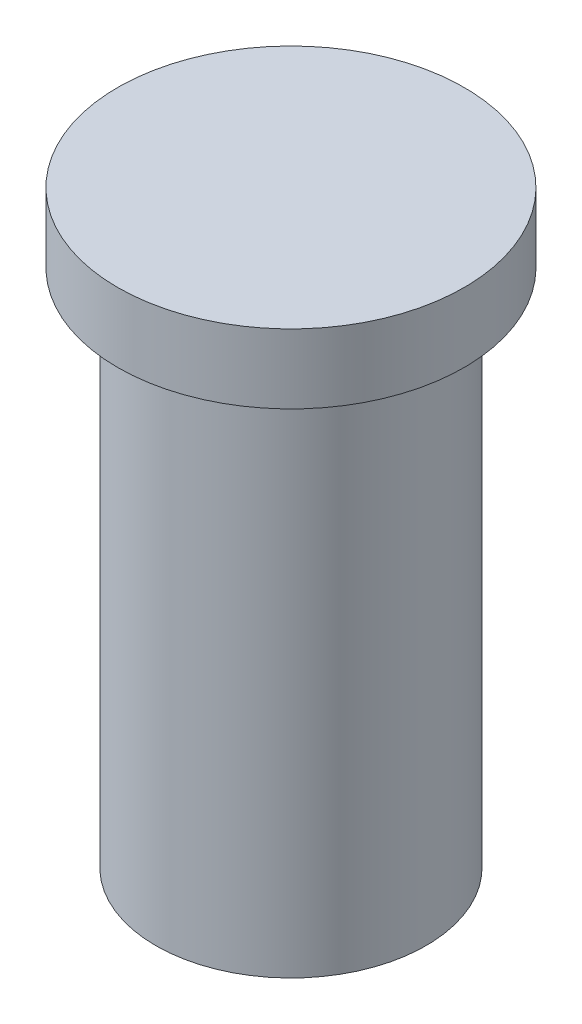
ISO-10303-21;
HEADER;
FILE_DESCRIPTION(('STEP AP214'),'2;1');
FILE_NAME('part.step','',(''),(''),'','','');
FILE_SCHEMA(('AUTOMOTIVE_DESIGN { 1 0 10303 214 1 1 1 1 }'));
ENDSEC;
DATA;
#1=APPLICATION_CONTEXT('core data for automotive mechanical design processes');
#2=APPLICATION_PROTOCOL_DEFINITION('international standard','automotive_design',2000,#1);
#3=PRODUCT_CONTEXT('',#1,'mechanical');
#4=PRODUCT('Part','Part','',(#3));
#5=PRODUCT_RELATED_PRODUCT_CATEGORY('part','',(#4));
#6=PRODUCT_DEFINITION_FORMATION('','',#4);
#7=PRODUCT_DEFINITION_CONTEXT('part definition',#1,'design');
#8=PRODUCT_DEFINITION('design','',#6,#7);
#9=PRODUCT_DEFINITION_SHAPE('','',#8);
#10=(LENGTH_UNIT() NAMED_UNIT(*) SI_UNIT(.MILLI.,.METRE.));
#11=(NAMED_UNIT(*) PLANE_ANGLE_UNIT() SI_UNIT($,.RADIAN.));
#12=(NAMED_UNIT(*) SI_UNIT($,.STERADIAN.) SOLID_ANGLE_UNIT());
#13=UNCERTAINTY_MEASURE_WITH_UNIT(LENGTH_MEASURE(1.E-05),#10,'distance_accuracy_value','');
#14=(GEOMETRIC_REPRESENTATION_CONTEXT(3) GLOBAL_UNCERTAINTY_ASSIGNED_CONTEXT((#13)) GLOBAL_UNIT_ASSIGNED_CONTEXT((#10,
#11,#12)) REPRESENTATION_CONTEXT('',''));
#15=CARTESIAN_POINT('',(0.,0.,0.));
#16=DIRECTION('',(0.,0.,1.));
#17=DIRECTION('',(1.,0.,0.));
#18=AXIS2_PLACEMENT_3D('',#15,#16,#17);
#19=CARTESIAN_POINT('',(0.,15.,0.));
#20=DIRECTION('',(0.,-1.,0.));
#21=DIRECTION('',(0.,0.,-1.));
#22=AXIS2_PLACEMENT_3D('',#19,#20,#21);
#23=CYLINDRICAL_SURFACE('',#22,3.9);
#24=CARTESIAN_POINT('',(0.,15.,0.));
#25=DIRECTION('',(0.,1.,0.));
#26=DIRECTION('',(0.,0.,1.));
#27=AXIS2_PLACEMENT_3D('',#24,#25,#26);
#28=CIRCLE('',#27,3.9);
#29=CARTESIAN_POINT('',(0.,15.,3.9));
#30=VERTEX_POINT('',#29);
#31=EDGE_CURVE('E10',#30,#30,#28,.T.);
#32=ORIENTED_EDGE('',*,*,#31,.F.);
#33=EDGE_LOOP('',(#32));
#34=FACE_BOUND('',#33,.T.);
#35=CARTESIAN_POINT('',(0.,0.,0.));
#36=DIRECTION('',(0.,1.,0.));
#37=DIRECTION('',(0.,0.,1.));
#38=AXIS2_PLACEMENT_3D('',#35,#36,#37);
#39=CIRCLE('',#38,3.9);
#40=CARTESIAN_POINT('',(0.,0.,3.9));
#41=VERTEX_POINT('',#40);
#42=EDGE_CURVE('E42',#41,#41,#39,.T.);
#43=ORIENTED_EDGE('',*,*,#42,.T.);
#44=EDGE_LOOP('',(#43));
#45=FACE_BOUND('',#44,.T.);
#46=ADVANCED_FACE('F39',(#34,#45),#23,.T.);
#47=CARTESIAN_POINT('',(0.,0.,0.));
#48=DIRECTION('',(0.,1.,0.));
#49=DIRECTION('',(0.,0.,1.));
#50=AXIS2_PLACEMENT_3D('',#47,#48,#49);
#51=PLANE('',#50);
#52=ORIENTED_EDGE('',*,*,#42,.F.);
#53=EDGE_LOOP('',(#52));
#54=FACE_BOUND('',#53,.T.);
#55=ADVANCED_FACE('F66',(#54),#51,.F.);
#56=CARTESIAN_POINT('',(0.,17.,0.));
#57=DIRECTION('',(0.,-1.,0.));
#58=DIRECTION('',(0.,0.,-1.));
#59=AXIS2_PLACEMENT_3D('',#56,#57,#58);
#60=CYLINDRICAL_SURFACE('',#59,5.);
#61=CARTESIAN_POINT('',(0.,17.,0.));
#62=DIRECTION('',(0.,1.,0.));
#63=DIRECTION('',(0.,0.,1.));
#64=AXIS2_PLACEMENT_3D('',#61,#62,#63);
#65=CIRCLE('',#64,5.);
#66=CARTESIAN_POINT('',(0.,17.,5.));
#67=VERTEX_POINT('',#66);
#68=EDGE_CURVE('E51',#67,#67,#65,.T.);
#69=ORIENTED_EDGE('',*,*,#68,.F.);
#70=EDGE_LOOP('',(#69));
#71=FACE_BOUND('',#70,.T.);
#72=CARTESIAN_POINT('',(0.,15.,0.));
#73=DIRECTION('',(0.,1.,0.));
#74=DIRECTION('',(0.,0.,1.));
#75=AXIS2_PLACEMENT_3D('',#72,#73,#74);
#76=CIRCLE('',#75,5.);
#77=CARTESIAN_POINT('',(0.,15.,5.));
#78=VERTEX_POINT('',#77);
#79=EDGE_CURVE('E53',#78,#78,#76,.T.);
#80=ORIENTED_EDGE('',*,*,#79,.T.);
#81=EDGE_LOOP('',(#80));
#82=FACE_BOUND('',#81,.T.);
#83=ADVANCED_FACE('F63',(#71,#82),#60,.T.);
#84=CARTESIAN_POINT('',(0.,17.,0.));
#85=DIRECTION('',(0.,1.,0.));
#86=DIRECTION('',(0.,0.,1.));
#87=AXIS2_PLACEMENT_3D('',#84,#85,#86);
#88=PLANE('',#87);
#89=ORIENTED_EDGE('',*,*,#68,.T.);
#90=EDGE_LOOP('',(#89));
#91=FACE_BOUND('',#90,.T.);
#92=ADVANCED_FACE('F61',(#91),#88,.T.);
#93=CARTESIAN_POINT('',(0.,15.,0.));
#94=DIRECTION('',(0.,1.,0.));
#95=DIRECTION('',(0.,0.,1.));
#96=AXIS2_PLACEMENT_3D('',#93,#94,#95);
#97=PLANE('',#96);
#98=ORIENTED_EDGE('',*,*,#31,.T.);
#99=EDGE_LOOP('',(#98));
#100=FACE_BOUND('',#99,.T.);
#101=ORIENTED_EDGE('',*,*,#79,.F.);
#102=EDGE_LOOP('',(#101));
#103=FACE_BOUND('',#102,.T.);
#104=ADVANCED_FACE('F70',(#100,#103),#97,.F.);
#105=CLOSED_SHELL('',(#46,#55,#83,#92,#104));
#106=MANIFOLD_SOLID_BREP('B2',#105);
#107=ADVANCED_BREP_SHAPE_REPRESENTATION('',(#18,#106),#14);
#108=SHAPE_DEFINITION_REPRESENTATION(#9,#107);
ENDSEC;
END-ISO-10303-21;
